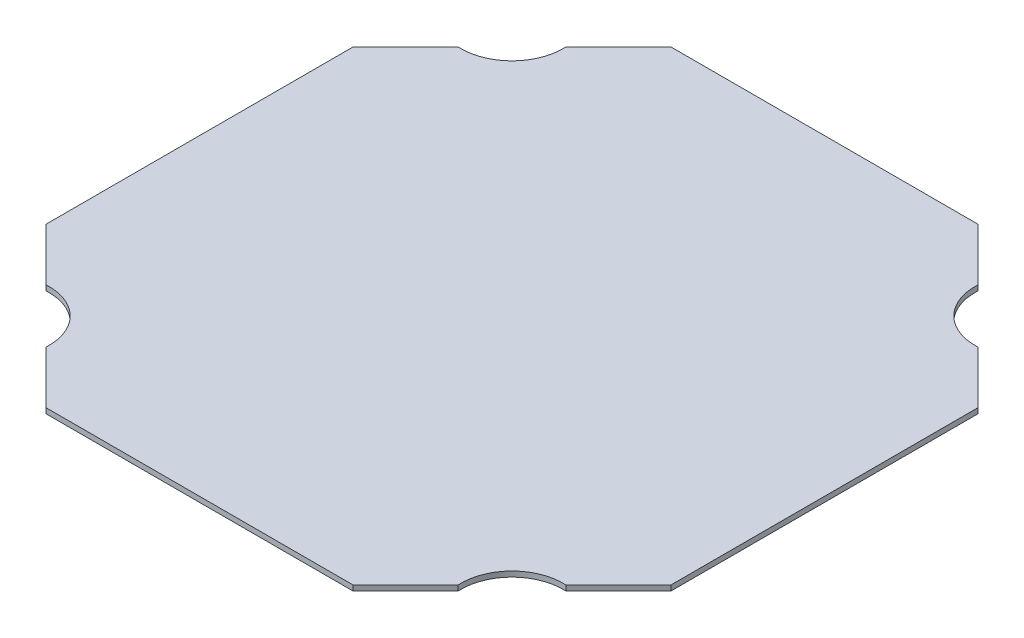
ISO-10303-21;
HEADER;
FILE_DESCRIPTION(('STEP AP214'),'2;1');
FILE_NAME('part.step','',(''),(''),'','','');
FILE_SCHEMA(('AUTOMOTIVE_DESIGN { 1 0 10303 214 1 1 1 1 }'));
ENDSEC;
DATA;
#1=APPLICATION_CONTEXT('core data for automotive mechanical design processes');
#2=APPLICATION_PROTOCOL_DEFINITION('international standard','automotive_design',2000,#1);
#3=PRODUCT_CONTEXT('',#1,'mechanical');
#4=PRODUCT('Part','Part','',(#3));
#5=PRODUCT_RELATED_PRODUCT_CATEGORY('part','',(#4));
#6=PRODUCT_DEFINITION_FORMATION('','',#4);
#7=PRODUCT_DEFINITION_CONTEXT('part definition',#1,'design');
#8=PRODUCT_DEFINITION('design','',#6,#7);
#9=PRODUCT_DEFINITION_SHAPE('','',#8);
#10=(LENGTH_UNIT() NAMED_UNIT(*) SI_UNIT(.MILLI.,.METRE.));
#11=(NAMED_UNIT(*) PLANE_ANGLE_UNIT() SI_UNIT($,.RADIAN.));
#12=(NAMED_UNIT(*) SI_UNIT($,.STERADIAN.) SOLID_ANGLE_UNIT());
#13=UNCERTAINTY_MEASURE_WITH_UNIT(LENGTH_MEASURE(1.E-05),#10,'distance_accuracy_value','');
#14=(GEOMETRIC_REPRESENTATION_CONTEXT(3) GLOBAL_UNCERTAINTY_ASSIGNED_CONTEXT((#13)) GLOBAL_UNIT_ASSIGNED_CONTEXT((#10,
#11,#12)) REPRESENTATION_CONTEXT('',''));
#15=CARTESIAN_POINT('',(0.,0.,0.));
#16=DIRECTION('',(0.,0.,1.));
#17=DIRECTION('',(1.,0.,0.));
#18=AXIS2_PLACEMENT_3D('',#15,#16,#17);
#19=CARTESIAN_POINT('',(66.5487893064983,6.35,-66.5487893064972));
#20=DIRECTION('',(0.,-1.,0.));
#21=DIRECTION('',(0.,0.,-1.));
#22=AXIS2_PLACEMENT_3D('',#19,#20,#21);
#23=CYLINDRICAL_SURFACE('',#22,61.137855626);
#24=CARTESIAN_POINT('',(66.5487893064983,0.,-66.5487893064972));
#25=DIRECTION('',(0.,1.,0.));
#26=DIRECTION('',(0.,0.,1.));
#27=AXIS2_PLACEMENT_3D('',#24,#25,#26);
#28=CIRCLE('',#27,61.137855626);
#29=CARTESIAN_POINT('',(127.57892203585,0.,-62.9210779641506));
#30=VERTEX_POINT('',#29);
#31=CARTESIAN_POINT('',(62.9210779641516,0.,-127.578922035848));
#32=VERTEX_POINT('',#31);
#33=EDGE_CURVE('E181',#30,#32,#28,.T.);
#34=ORIENTED_EDGE('',*,*,#33,.F.);
#35=DIRECTION('',(0.,-1.,0.));
#36=VECTOR('',#35,1.);
#37=CARTESIAN_POINT('',(127.57892203585,6.35,-62.9210779641506));
#38=LINE('',#37,#36);
#39=CARTESIAN_POINT('',(127.57892203585,6.35,-62.9210779641506));
#40=VERTEX_POINT('',#39);
#41=EDGE_CURVE('E11',#40,#30,#38,.T.);
#42=ORIENTED_EDGE('',*,*,#41,.F.);
#43=CARTESIAN_POINT('',(66.5487893064983,6.35,-66.5487893064972));
#44=DIRECTION('',(0.,1.,0.));
#45=DIRECTION('',(0.,0.,1.));
#46=AXIS2_PLACEMENT_3D('',#43,#44,#45);
#47=CIRCLE('',#46,61.137855626);
#48=CARTESIAN_POINT('',(62.9210779641516,6.35,-127.578922035848));
#49=VERTEX_POINT('',#48);
#50=EDGE_CURVE('E218',#40,#49,#47,.T.);
#51=ORIENTED_EDGE('',*,*,#50,.T.);
#52=DIRECTION('',(0.,-1.,0.));
#53=VECTOR('',#52,1.);
#54=CARTESIAN_POINT('',(62.9210779641516,6.35,-127.578922035848));
#55=LINE('',#54,#53);
#56=EDGE_CURVE('E56',#49,#32,#55,.T.);
#57=ORIENTED_EDGE('',*,*,#56,.T.);
#58=EDGE_LOOP('',(#34,#42,#51,#57));
#59=FACE_BOUND('',#58,.T.);
#60=ADVANCED_FACE('F40',(#59),#23,.F.);
#61=CARTESIAN_POINT('',(95.2499999999996,6.35,-95.2500000000004));
#62=DIRECTION('',(-0.707106781186545,0.,0.70710678118655));
#63=DIRECTION('',(0.70710678118655,0.,0.707106781186545));
#64=AXIS2_PLACEMENT_3D('',#61,#62,#63);
#65=PLANE('',#64);
#66=DIRECTION('',(-0.70710678118655,0.,-0.707106781186545));
#67=VECTOR('',#66,1.);
#68=CARTESIAN_POINT('',(95.2499999999996,0.,-95.2500000000004));
#69=LINE('',#68,#67);
#70=CARTESIAN_POINT('',(190.500000000001,0.,0.));
#71=VERTEX_POINT('',#70);
#72=EDGE_CURVE('E183',#71,#30,#69,.T.);
#73=ORIENTED_EDGE('',*,*,#72,.F.);
#74=DIRECTION('',(0.,-1.,0.));
#75=VECTOR('',#74,1.);
#76=CARTESIAN_POINT('',(190.500000000001,6.35,0.));
#77=LINE('',#76,#75);
#78=CARTESIAN_POINT('',(190.500000000001,6.35,0.));
#79=VERTEX_POINT('',#78);
#80=EDGE_CURVE('E48',#79,#71,#77,.T.);
#81=ORIENTED_EDGE('',*,*,#80,.F.);
#82=DIRECTION('',(-0.70710678118655,0.,-0.707106781186545));
#83=VECTOR('',#82,1.);
#84=CARTESIAN_POINT('',(95.2499999999996,6.35,-95.2500000000004));
#85=LINE('',#84,#83);
#86=EDGE_CURVE('E262',#79,#40,#85,.T.);
#87=ORIENTED_EDGE('',*,*,#86,.T.);
#88=ORIENTED_EDGE('',*,*,#41,.T.);
#89=EDGE_LOOP('',(#73,#81,#87,#88));
#90=FACE_BOUND('',#89,.T.);
#91=ADVANCED_FACE('F261',(#90),#65,.T.);
#92=CARTESIAN_POINT('',(0.,6.35,0.));
#93=DIRECTION('',(0.,0.,-1.));
#94=DIRECTION('',(-1.,0.,0.));
#95=AXIS2_PLACEMENT_3D('',#92,#93,#94);
#96=PLANE('',#95);
#97=DIRECTION('',(1.,0.,0.));
#98=VECTOR('',#97,1.);
#99=CARTESIAN_POINT('',(0.,0.,0.));
#100=LINE('',#99,#98);
#101=CARTESIAN_POINT('',(558.8,0.,0.));
#102=VERTEX_POINT('',#101);
#103=EDGE_CURVE('E186',#71,#102,#100,.T.);
#104=ORIENTED_EDGE('',*,*,#103,.T.);
#105=DIRECTION('',(0.,-1.,0.));
#106=VECTOR('',#105,1.);
#107=CARTESIAN_POINT('',(558.8,6.35,0.));
#108=LINE('',#107,#106);
#109=CARTESIAN_POINT('',(558.8,6.35,0.));
#110=VERTEX_POINT('',#109);
#111=EDGE_CURVE('E245',#110,#102,#108,.T.);
#112=ORIENTED_EDGE('',*,*,#111,.F.);
#113=DIRECTION('',(1.,0.,0.));
#114=VECTOR('',#113,1.);
#115=CARTESIAN_POINT('',(0.,6.35,0.));
#116=LINE('',#115,#114);
#117=EDGE_CURVE('E252',#79,#110,#116,.T.);
#118=ORIENTED_EDGE('',*,*,#117,.F.);
#119=ORIENTED_EDGE('',*,*,#80,.T.);
#120=EDGE_LOOP('',(#104,#112,#118,#119));
#121=FACE_BOUND('',#120,.T.);
#122=ADVANCED_FACE('F250',(#121),#96,.F.);
#123=CARTESIAN_POINT('',(279.399999999999,6.35,279.4));
#124=DIRECTION('',(-0.707106781186546,0.,-0.707106781186549));
#125=DIRECTION('',(-0.707106781186549,0.,0.707106781186546));
#126=AXIS2_PLACEMENT_3D('',#123,#124,#125);
#127=PLANE('',#126);
#128=DIRECTION('',(0.707106781186549,0.,-0.707106781186546));
#129=VECTOR('',#128,1.);
#130=CARTESIAN_POINT('',(279.399999999999,0.,279.4));
#131=LINE('',#130,#129);
#132=CARTESIAN_POINT('',(621.721077964151,0.,-62.9210779641508));
#133=VERTEX_POINT('',#132);
#134=EDGE_CURVE('E188',#102,#133,#131,.T.);
#135=ORIENTED_EDGE('',*,*,#134,.T.);
#136=DIRECTION('',(0.,-1.,0.));
#137=VECTOR('',#136,1.);
#138=CARTESIAN_POINT('',(621.721077964151,6.35,-62.9210779641508));
#139=LINE('',#138,#137);
#140=CARTESIAN_POINT('',(621.721077964151,6.35,-62.9210779641508));
#141=VERTEX_POINT('',#140);
#142=EDGE_CURVE('E242',#141,#133,#139,.T.);
#143=ORIENTED_EDGE('',*,*,#142,.F.);
#144=DIRECTION('',(0.707106781186549,0.,-0.707106781186546));
#145=VECTOR('',#144,1.);
#146=CARTESIAN_POINT('',(279.399999999999,6.35,279.4));
#147=LINE('',#146,#145);
#148=EDGE_CURVE('E519',#110,#141,#147,.T.);
#149=ORIENTED_EDGE('',*,*,#148,.F.);
#150=ORIENTED_EDGE('',*,*,#111,.T.);
#151=EDGE_LOOP('',(#135,#143,#149,#150));
#152=FACE_BOUND('',#151,.T.);
#153=ADVANCED_FACE('F280',(#152),#127,.F.);
#154=CARTESIAN_POINT('',(682.751210693502,6.35,-66.5487893064977));
#155=DIRECTION('',(0.,-1.,0.));
#156=DIRECTION('',(0.,0.,-1.));
#157=AXIS2_PLACEMENT_3D('',#154,#155,#156);
#158=CYLINDRICAL_SURFACE('',#157,61.137855626);
#159=CARTESIAN_POINT('',(682.751210693502,0.,-66.5487893064977));
#160=DIRECTION('',(0.,1.,0.));
#161=DIRECTION('',(0.,0.,1.));
#162=AXIS2_PLACEMENT_3D('',#159,#160,#161);
#163=CIRCLE('',#162,61.137855626);
#164=CARTESIAN_POINT('',(686.378922035849,0.,-127.578922035849));
#165=VERTEX_POINT('',#164);
#166=EDGE_CURVE('E190',#133,#165,#163,.F.);
#167=ORIENTED_EDGE('',*,*,#166,.T.);
#168=DIRECTION('',(0.,-1.,0.));
#169=VECTOR('',#168,1.);
#170=CARTESIAN_POINT('',(686.378922035849,6.35,-127.578922035849));
#171=LINE('',#170,#169);
#172=CARTESIAN_POINT('',(686.378922035849,6.35,-127.578922035849));
#173=VERTEX_POINT('',#172);
#174=EDGE_CURVE('E239',#173,#165,#171,.T.);
#175=ORIENTED_EDGE('',*,*,#174,.F.);
#176=CARTESIAN_POINT('',(682.751210693502,6.35,-66.5487893064977));
#177=DIRECTION('',(0.,1.,0.));
#178=DIRECTION('',(0.,0.,1.));
#179=AXIS2_PLACEMENT_3D('',#176,#177,#178);
#180=CIRCLE('',#179,61.137855626);
#181=EDGE_CURVE('E516',#141,#173,#180,.F.);
#182=ORIENTED_EDGE('',*,*,#181,.F.);
#183=ORIENTED_EDGE('',*,*,#142,.T.);
#184=EDGE_LOOP('',(#167,#175,#182,#183));
#185=FACE_BOUND('',#184,.T.);
#186=ADVANCED_FACE('F285',(#185),#158,.F.);
#187=CARTESIAN_POINT('',(279.400000000002,6.35,279.4));
#188=DIRECTION('',(-0.707106781186549,0.,-0.707106781186546));
#189=DIRECTION('',(-0.707106781186546,0.,0.707106781186549));
#190=AXIS2_PLACEMENT_3D('',#187,#188,#189);
#191=PLANE('',#190);
#192=DIRECTION('',(0.707106781186546,0.,-0.707106781186549));
#193=VECTOR('',#192,1.);
#194=CARTESIAN_POINT('',(279.400000000002,0.,279.4));
#195=LINE('',#194,#193);
#196=CARTESIAN_POINT('',(749.3,0.,-190.5));
#197=VERTEX_POINT('',#196);
#198=EDGE_CURVE('E192',#165,#197,#195,.T.);
#199=ORIENTED_EDGE('',*,*,#198,.T.);
#200=DIRECTION('',(0.,-1.,0.));
#201=VECTOR('',#200,1.);
#202=CARTESIAN_POINT('',(749.3,6.35,-190.5));
#203=LINE('',#202,#201);
#204=CARTESIAN_POINT('',(749.3,6.35,-190.5));
#205=VERTEX_POINT('',#204);
#206=EDGE_CURVE('E236',#205,#197,#203,.T.);
#207=ORIENTED_EDGE('',*,*,#206,.F.);
#208=DIRECTION('',(0.707106781186546,0.,-0.707106781186549));
#209=VECTOR('',#208,1.);
#210=CARTESIAN_POINT('',(279.400000000002,6.35,279.4));
#211=LINE('',#210,#209);
#212=EDGE_CURVE('E514',#173,#205,#211,.T.);
#213=ORIENTED_EDGE('',*,*,#212,.F.);
#214=ORIENTED_EDGE('',*,*,#174,.T.);
#215=EDGE_LOOP('',(#199,#207,#213,#214));
#216=FACE_BOUND('',#215,.T.);
#217=ADVANCED_FACE('F289',(#216),#191,.F.);
#218=CARTESIAN_POINT('',(749.3,6.35,0.));
#219=DIRECTION('',(-1.,0.,0.));
#220=DIRECTION('',(0.,0.,1.));
#221=AXIS2_PLACEMENT_3D('',#218,#219,#220);
#222=PLANE('',#221);
#223=DIRECTION('',(0.,0.,-1.));
#224=VECTOR('',#223,1.);
#225=CARTESIAN_POINT('',(749.3,0.,0.));
#226=LINE('',#225,#224);
#227=CARTESIAN_POINT('',(749.3,0.,-558.799999999999));
#228=VERTEX_POINT('',#227);
#229=EDGE_CURVE('E194',#197,#228,#226,.T.);
#230=ORIENTED_EDGE('',*,*,#229,.T.);
#231=DIRECTION('',(0.,-1.,0.));
#232=VECTOR('',#231,1.);
#233=CARTESIAN_POINT('',(749.3,6.35,-558.799999999999));
#234=LINE('',#233,#232);
#235=CARTESIAN_POINT('',(749.3,6.35,-558.799999999999));
#236=VERTEX_POINT('',#235);
#237=EDGE_CURVE('E234',#236,#228,#234,.T.);
#238=ORIENTED_EDGE('',*,*,#237,.F.);
#239=DIRECTION('',(0.,0.,-1.));
#240=VECTOR('',#239,1.);
#241=CARTESIAN_POINT('',(749.3,6.35,0.));
#242=LINE('',#241,#240);
#243=EDGE_CURVE('E526',#205,#236,#242,.T.);
#244=ORIENTED_EDGE('',*,*,#243,.F.);
#245=ORIENTED_EDGE('',*,*,#206,.T.);
#246=EDGE_LOOP('',(#230,#238,#244,#245));
#247=FACE_BOUND('',#246,.T.);
#248=ADVANCED_FACE('F293',(#247),#222,.F.);
#249=CARTESIAN_POINT('',(654.050000000001,6.35,-654.049999999999));
#250=DIRECTION('',(0.707106781186549,0.,-0.707106781186546));
#251=DIRECTION('',(-0.707106781186546,0.,-0.707106781186549));
#252=AXIS2_PLACEMENT_3D('',#249,#250,#251);
#253=PLANE('',#252);
#254=DIRECTION('',(0.707106781186546,0.,0.707106781186549));
#255=VECTOR('',#254,1.);
#256=CARTESIAN_POINT('',(654.050000000001,0.,-654.049999999999));
#257=LINE('',#256,#255);
#258=CARTESIAN_POINT('',(686.378922035849,0.,-621.721077964151));
#259=VERTEX_POINT('',#258);
#260=EDGE_CURVE('E197',#259,#228,#257,.T.);
#261=ORIENTED_EDGE('',*,*,#260,.F.);
#262=DIRECTION('',(0.,-1.,0.));
#263=VECTOR('',#262,1.);
#264=CARTESIAN_POINT('',(686.378922035849,6.35,-621.721077964151));
#265=LINE('',#264,#263);
#266=CARTESIAN_POINT('',(686.378922035849,6.35,-621.721077964151));
#267=VERTEX_POINT('',#266);
#268=EDGE_CURVE('E232',#267,#259,#265,.T.);
#269=ORIENTED_EDGE('',*,*,#268,.F.);
#270=DIRECTION('',(0.707106781186546,0.,0.707106781186549));
#271=VECTOR('',#270,1.);
#272=CARTESIAN_POINT('',(654.050000000001,6.35,-654.049999999999));
#273=LINE('',#272,#271);
#274=EDGE_CURVE('E508',#267,#236,#273,.T.);
#275=ORIENTED_EDGE('',*,*,#274,.T.);
#276=ORIENTED_EDGE('',*,*,#237,.T.);
#277=EDGE_LOOP('',(#261,#269,#275,#276));
#278=FACE_BOUND('',#277,.T.);
#279=ADVANCED_FACE('F297',(#278),#253,.T.);
#280=CARTESIAN_POINT('',(682.751210693502,6.35,-682.751210693502));
#281=DIRECTION('',(0.,-1.,0.));
#282=DIRECTION('',(0.,0.,-1.));
#283=AXIS2_PLACEMENT_3D('',#280,#281,#282);
#284=CYLINDRICAL_SURFACE('',#283,61.137855626);
#285=CARTESIAN_POINT('',(682.751210693502,0.,-682.751210693502));
#286=DIRECTION('',(0.,1.,0.));
#287=DIRECTION('',(0.,0.,1.));
#288=AXIS2_PLACEMENT_3D('',#285,#286,#287);
#289=CIRCLE('',#288,61.137855626);
#290=CARTESIAN_POINT('',(621.721077964151,0.,-686.378922035849));
#291=VERTEX_POINT('',#290);
#292=EDGE_CURVE('E200',#291,#259,#289,.T.);
#293=ORIENTED_EDGE('',*,*,#292,.F.);
#294=DIRECTION('',(0.,-1.,0.));
#295=VECTOR('',#294,1.);
#296=CARTESIAN_POINT('',(621.721077964151,6.35,-686.378922035849));
#297=LINE('',#296,#295);
#298=CARTESIAN_POINT('',(621.721077964151,6.35,-686.378922035849));
#299=VERTEX_POINT('',#298);
#300=EDGE_CURVE('E230',#299,#291,#297,.T.);
#301=ORIENTED_EDGE('',*,*,#300,.F.);
#302=CARTESIAN_POINT('',(682.751210693502,6.35,-682.751210693502));
#303=DIRECTION('',(0.,1.,0.));
#304=DIRECTION('',(0.,0.,1.));
#305=AXIS2_PLACEMENT_3D('',#302,#303,#304);
#306=CIRCLE('',#305,61.137855626);
#307=EDGE_CURVE('E504',#299,#267,#306,.T.);
#308=ORIENTED_EDGE('',*,*,#307,.T.);
#309=ORIENTED_EDGE('',*,*,#268,.T.);
#310=EDGE_LOOP('',(#293,#301,#308,#309));
#311=FACE_BOUND('',#310,.T.);
#312=ADVANCED_FACE('F301',(#311),#284,.F.);
#313=CARTESIAN_POINT('',(654.049999999998,6.35,-654.050000000002));
#314=DIRECTION('',(0.707106781186546,0.,-0.707106781186549));
#315=DIRECTION('',(-0.707106781186549,0.,-0.707106781186546));
#316=AXIS2_PLACEMENT_3D('',#313,#314,#315);
#317=PLANE('',#316);
#318=DIRECTION('',(0.707106781186549,0.,0.707106781186546));
#319=VECTOR('',#318,1.);
#320=CARTESIAN_POINT('',(654.049999999998,0.,-654.050000000002));
#321=LINE('',#320,#319);
#322=CARTESIAN_POINT('',(558.8,0.,-749.3));
#323=VERTEX_POINT('',#322);
#324=EDGE_CURVE('E203',#323,#291,#321,.T.);
#325=ORIENTED_EDGE('',*,*,#324,.F.);
#326=DIRECTION('',(0.,-1.,0.));
#327=VECTOR('',#326,1.);
#328=CARTESIAN_POINT('',(558.8,6.35,-749.3));
#329=LINE('',#328,#327);
#330=CARTESIAN_POINT('',(558.8,6.35,-749.3));
#331=VERTEX_POINT('',#330);
#332=EDGE_CURVE('E228',#331,#323,#329,.T.);
#333=ORIENTED_EDGE('',*,*,#332,.F.);
#334=DIRECTION('',(0.707106781186549,0.,0.707106781186546));
#335=VECTOR('',#334,1.);
#336=CARTESIAN_POINT('',(654.049999999998,6.35,-654.050000000002));
#337=LINE('',#336,#335);
#338=EDGE_CURVE('E498',#331,#299,#337,.T.);
#339=ORIENTED_EDGE('',*,*,#338,.T.);
#340=ORIENTED_EDGE('',*,*,#300,.T.);
#341=EDGE_LOOP('',(#325,#333,#339,#340));
#342=FACE_BOUND('',#341,.T.);
#343=ADVANCED_FACE('F305',(#342),#317,.T.);
#344=CARTESIAN_POINT('',(1.11022302462516E-13,6.35,-749.3));
#345=DIRECTION('',(0.,0.,1.));
#346=DIRECTION('',(1.,0.,0.));
#347=AXIS2_PLACEMENT_3D('',#344,#345,#346);
#348=PLANE('',#347);
#349=DIRECTION('',(-1.,0.,0.));
#350=VECTOR('',#349,1.);
#351=CARTESIAN_POINT('',(1.11022302462516E-13,0.,-749.3));
#352=LINE('',#351,#350);
#353=CARTESIAN_POINT('',(190.500000000001,0.,-749.3));
#354=VERTEX_POINT('',#353);
#355=EDGE_CURVE('E206',#323,#354,#352,.T.);
#356=ORIENTED_EDGE('',*,*,#355,.T.);
#357=DIRECTION('',(0.,-1.,0.));
#358=VECTOR('',#357,1.);
#359=CARTESIAN_POINT('',(190.500000000001,6.35,-749.3));
#360=LINE('',#359,#358);
#361=CARTESIAN_POINT('',(190.500000000001,6.35,-749.3));
#362=VERTEX_POINT('',#361);
#363=EDGE_CURVE('E225',#362,#354,#360,.T.);
#364=ORIENTED_EDGE('',*,*,#363,.F.);
#365=DIRECTION('',(-1.,0.,0.));
#366=VECTOR('',#365,1.);
#367=CARTESIAN_POINT('',(1.11022302462516E-13,6.35,-749.3));
#368=LINE('',#367,#366);
#369=EDGE_CURVE('E495',#331,#362,#368,.T.);
#370=ORIENTED_EDGE('',*,*,#369,.F.);
#371=ORIENTED_EDGE('',*,*,#332,.T.);
#372=EDGE_LOOP('',(#356,#364,#370,#371));
#373=FACE_BOUND('',#372,.T.);
#374=ADVANCED_FACE('F309',(#373),#348,.F.);
#375=CARTESIAN_POINT('',(-279.4,6.35,-279.400000000002));
#376=DIRECTION('',(0.707106781186545,0.,0.70710678118655));
#377=DIRECTION('',(0.70710678118655,0.,-0.707106781186545));
#378=AXIS2_PLACEMENT_3D('',#375,#376,#377);
#379=PLANE('',#378);
#380=DIRECTION('',(-0.70710678118655,0.,0.707106781186545));
#381=VECTOR('',#380,1.);
#382=CARTESIAN_POINT('',(-279.4,0.,-279.400000000002));
#383=LINE('',#382,#381);
#384=CARTESIAN_POINT('',(127.578922035849,0.,-686.378922035849));
#385=VERTEX_POINT('',#384);
#386=EDGE_CURVE('E208',#354,#385,#383,.T.);
#387=ORIENTED_EDGE('',*,*,#386,.T.);
#388=DIRECTION('',(0.,-1.,0.));
#389=VECTOR('',#388,1.);
#390=CARTESIAN_POINT('',(127.578922035849,6.35,-686.378922035849));
#391=LINE('',#390,#389);
#392=CARTESIAN_POINT('',(127.578922035849,6.35,-686.378922035849));
#393=VERTEX_POINT('',#392);
#394=EDGE_CURVE('E222',#393,#385,#391,.T.);
#395=ORIENTED_EDGE('',*,*,#394,.F.);
#396=DIRECTION('',(-0.70710678118655,0.,0.707106781186545));
#397=VECTOR('',#396,1.);
#398=CARTESIAN_POINT('',(-279.4,6.35,-279.400000000002));
#399=LINE('',#398,#397);
#400=EDGE_CURVE('E493',#362,#393,#399,.T.);
#401=ORIENTED_EDGE('',*,*,#400,.F.);
#402=ORIENTED_EDGE('',*,*,#363,.T.);
#403=EDGE_LOOP('',(#387,#395,#401,#402));
#404=FACE_BOUND('',#403,.T.);
#405=ADVANCED_FACE('F313',(#404),#379,.F.);
#406=CARTESIAN_POINT('',(66.5487893064979,6.35,-682.751210693503));
#407=DIRECTION('',(0.,-1.,0.));
#408=DIRECTION('',(0.,0.,-1.));
#409=AXIS2_PLACEMENT_3D('',#406,#407,#408);
#410=CYLINDRICAL_SURFACE('',#409,61.137855626);
#411=CARTESIAN_POINT('',(66.5487893064979,0.,-682.751210693503));
#412=DIRECTION('',(0.,1.,0.));
#413=DIRECTION('',(0.,0.,1.));
#414=AXIS2_PLACEMENT_3D('',#411,#412,#413);
#415=CIRCLE('',#414,61.137855626);
#416=CARTESIAN_POINT('',(62.9210779641511,0.,-621.721077964151));
#417=VERTEX_POINT('',#416);
#418=EDGE_CURVE('E210',#385,#417,#415,.F.);
#419=ORIENTED_EDGE('',*,*,#418,.T.);
#420=DIRECTION('',(0.,-1.,0.));
#421=VECTOR('',#420,1.);
#422=CARTESIAN_POINT('',(62.9210779641511,6.35,-621.721077964151));
#423=LINE('',#422,#421);
#424=CARTESIAN_POINT('',(62.9210779641511,6.35,-621.721077964151));
#425=VERTEX_POINT('',#424);
#426=EDGE_CURVE('E173',#425,#417,#423,.T.);
#427=ORIENTED_EDGE('',*,*,#426,.F.);
#428=CARTESIAN_POINT('',(66.5487893064979,6.35,-682.751210693503));
#429=DIRECTION('',(0.,1.,0.));
#430=DIRECTION('',(0.,0.,1.));
#431=AXIS2_PLACEMENT_3D('',#428,#429,#430);
#432=CIRCLE('',#431,61.137855626);
#433=EDGE_CURVE('E161',#393,#425,#432,.F.);
#434=ORIENTED_EDGE('',*,*,#433,.F.);
#435=ORIENTED_EDGE('',*,*,#394,.T.);
#436=EDGE_LOOP('',(#419,#427,#434,#435));
#437=FACE_BOUND('',#436,.T.);
#438=ADVANCED_FACE('F317',(#437),#410,.F.);
#439=CARTESIAN_POINT('',(-279.4,6.35,-279.399999999999));
#440=DIRECTION('',(0.707106781186549,0.,0.707106781186546));
#441=DIRECTION('',(0.707106781186546,0.,-0.707106781186549));
#442=AXIS2_PLACEMENT_3D('',#439,#440,#441);
#443=PLANE('',#442);
#444=DIRECTION('',(-0.707106781186546,0.,0.707106781186549));
#445=VECTOR('',#444,1.);
#446=CARTESIAN_POINT('',(-279.4,0.,-279.399999999999));
#447=LINE('',#446,#445);
#448=CARTESIAN_POINT('',(0.,0.,-558.8));
#449=VERTEX_POINT('',#448);
#450=EDGE_CURVE('E170',#417,#449,#447,.T.);
#451=ORIENTED_EDGE('',*,*,#450,.T.);
#452=DIRECTION('',(0.,-1.,0.));
#453=VECTOR('',#452,1.);
#454=CARTESIAN_POINT('',(0.,6.35,-558.8));
#455=LINE('',#454,#453);
#456=CARTESIAN_POINT('',(0.,6.35,-558.8));
#457=VERTEX_POINT('',#456);
#458=EDGE_CURVE('E167',#457,#449,#455,.T.);
#459=ORIENTED_EDGE('',*,*,#458,.F.);
#460=DIRECTION('',(-0.707106781186546,0.,0.707106781186549));
#461=VECTOR('',#460,1.);
#462=CARTESIAN_POINT('',(-279.4,6.35,-279.399999999999));
#463=LINE('',#462,#461);
#464=EDGE_CURVE('E154',#425,#457,#463,.T.);
#465=ORIENTED_EDGE('',*,*,#464,.F.);
#466=ORIENTED_EDGE('',*,*,#426,.T.);
#467=EDGE_LOOP('',(#451,#459,#465,#466));
#468=FACE_BOUND('',#467,.T.);
#469=ADVANCED_FACE('F168',(#468),#443,.F.);
#470=CARTESIAN_POINT('',(0.,6.35,0.));
#471=DIRECTION('',(-1.,0.,0.));
#472=DIRECTION('',(0.,0.,1.));
#473=AXIS2_PLACEMENT_3D('',#470,#471,#472);
#474=PLANE('',#473);
#475=DIRECTION('',(0.,0.,-1.));
#476=VECTOR('',#475,1.);
#477=CARTESIAN_POINT('',(0.,0.,0.));
#478=LINE('',#477,#476);
#479=CARTESIAN_POINT('',(0.,0.,-190.5));
#480=VERTEX_POINT('',#479);
#481=EDGE_CURVE('E213',#480,#449,#478,.T.);
#482=ORIENTED_EDGE('',*,*,#481,.F.);
#483=DIRECTION('',(0.,-1.,0.));
#484=VECTOR('',#483,1.);
#485=CARTESIAN_POINT('',(0.,6.35,-190.5));
#486=LINE('',#485,#484);
#487=CARTESIAN_POINT('',(0.,6.35,-190.5));
#488=VERTEX_POINT('',#487);
#489=EDGE_CURVE('E105',#488,#480,#486,.T.);
#490=ORIENTED_EDGE('',*,*,#489,.F.);
#491=DIRECTION('',(0.,0.,-1.));
#492=VECTOR('',#491,1.);
#493=CARTESIAN_POINT('',(0.,6.35,0.));
#494=LINE('',#493,#492);
#495=EDGE_CURVE('E159',#488,#457,#494,.T.);
#496=ORIENTED_EDGE('',*,*,#495,.T.);
#497=ORIENTED_EDGE('',*,*,#458,.T.);
#498=EDGE_LOOP('',(#482,#490,#496,#497));
#499=FACE_BOUND('',#498,.T.);
#500=ADVANCED_FACE('F175',(#499),#474,.T.);
#501=CARTESIAN_POINT('',(95.2500000000001,6.35,-95.2499999999998));
#502=DIRECTION('',(-0.707106781186549,0.,0.707106781186546));
#503=DIRECTION('',(0.707106781186546,0.,0.707106781186549));
#504=AXIS2_PLACEMENT_3D('',#501,#502,#503);
#505=PLANE('',#504);
#506=DIRECTION('',(-0.707106781186546,0.,-0.707106781186549));
#507=VECTOR('',#506,1.);
#508=CARTESIAN_POINT('',(95.2500000000001,0.,-95.2499999999998));
#509=LINE('',#508,#507);
#510=EDGE_CURVE('E215',#32,#480,#509,.T.);
#511=ORIENTED_EDGE('',*,*,#510,.F.);
#512=ORIENTED_EDGE('',*,*,#56,.F.);
#513=DIRECTION('',(-0.707106781186546,0.,-0.707106781186549));
#514=VECTOR('',#513,1.);
#515=CARTESIAN_POINT('',(95.2500000000001,6.35,-95.2499999999998));
#516=LINE('',#515,#514);
#517=EDGE_CURVE('E176',#49,#488,#516,.T.);
#518=ORIENTED_EDGE('',*,*,#517,.T.);
#519=ORIENTED_EDGE('',*,*,#489,.T.);
#520=EDGE_LOOP('',(#511,#512,#518,#519));
#521=FACE_BOUND('',#520,.T.);
#522=ADVANCED_FACE('F263',(#521),#505,.T.);
#523=CARTESIAN_POINT('',(0.,6.35,0.));
#524=DIRECTION('',(0.,1.,0.));
#525=DIRECTION('',(0.,0.,1.));
#526=AXIS2_PLACEMENT_3D('',#523,#524,#525);
#527=PLANE('',#526);
#528=ORIENTED_EDGE('',*,*,#50,.F.);
#529=ORIENTED_EDGE('',*,*,#86,.F.);
#530=ORIENTED_EDGE('',*,*,#117,.T.);
#531=ORIENTED_EDGE('',*,*,#148,.T.);
#532=ORIENTED_EDGE('',*,*,#181,.T.);
#533=ORIENTED_EDGE('',*,*,#212,.T.);
#534=ORIENTED_EDGE('',*,*,#243,.T.);
#535=ORIENTED_EDGE('',*,*,#274,.F.);
#536=ORIENTED_EDGE('',*,*,#307,.F.);
#537=ORIENTED_EDGE('',*,*,#338,.F.);
#538=ORIENTED_EDGE('',*,*,#369,.T.);
#539=ORIENTED_EDGE('',*,*,#400,.T.);
#540=ORIENTED_EDGE('',*,*,#433,.T.);
#541=ORIENTED_EDGE('',*,*,#464,.T.);
#542=ORIENTED_EDGE('',*,*,#495,.F.);
#543=ORIENTED_EDGE('',*,*,#517,.F.);
#544=EDGE_LOOP('',(#528,#529,#530,#531,#532,#533,#534,#535,#536,#537,#538,#539,#540,#541,#542,#543));
#545=FACE_BOUND('',#544,.T.);
#546=ADVANCED_FACE('F156',(#545),#527,.T.);
#547=CARTESIAN_POINT('',(0.,0.,0.));
#548=DIRECTION('',(0.,1.,0.));
#549=DIRECTION('',(0.,0.,1.));
#550=AXIS2_PLACEMENT_3D('',#547,#548,#549);
#551=PLANE('',#550);
#552=ORIENTED_EDGE('',*,*,#33,.T.);
#553=ORIENTED_EDGE('',*,*,#510,.T.);
#554=ORIENTED_EDGE('',*,*,#481,.T.);
#555=ORIENTED_EDGE('',*,*,#450,.F.);
#556=ORIENTED_EDGE('',*,*,#418,.F.);
#557=ORIENTED_EDGE('',*,*,#386,.F.);
#558=ORIENTED_EDGE('',*,*,#355,.F.);
#559=ORIENTED_EDGE('',*,*,#324,.T.);
#560=ORIENTED_EDGE('',*,*,#292,.T.);
#561=ORIENTED_EDGE('',*,*,#260,.T.);
#562=ORIENTED_EDGE('',*,*,#229,.F.);
#563=ORIENTED_EDGE('',*,*,#198,.F.);
#564=ORIENTED_EDGE('',*,*,#166,.F.);
#565=ORIENTED_EDGE('',*,*,#134,.F.);
#566=ORIENTED_EDGE('',*,*,#103,.F.);
#567=ORIENTED_EDGE('',*,*,#72,.T.);
#568=EDGE_LOOP('',(#552,#553,#554,#555,#556,#557,#558,#559,#560,#561,#562,#563,#564,#565,#566,#567));
#569=FACE_BOUND('',#568,.T.);
#570=ADVANCED_FACE('F259',(#569),#551,.F.);
#571=CLOSED_SHELL('',(#60,#91,#122,#153,#186,#217,#248,#279,#312,#343,#374,#405,#438,#469,#500,
#522,#546,#570));
#572=MANIFOLD_SOLID_BREP('B2',#571);
#573=ADVANCED_BREP_SHAPE_REPRESENTATION('',(#18,#572),#14);
#574=SHAPE_DEFINITION_REPRESENTATION(#9,#573);
ENDSEC;
END-ISO-10303-21;
